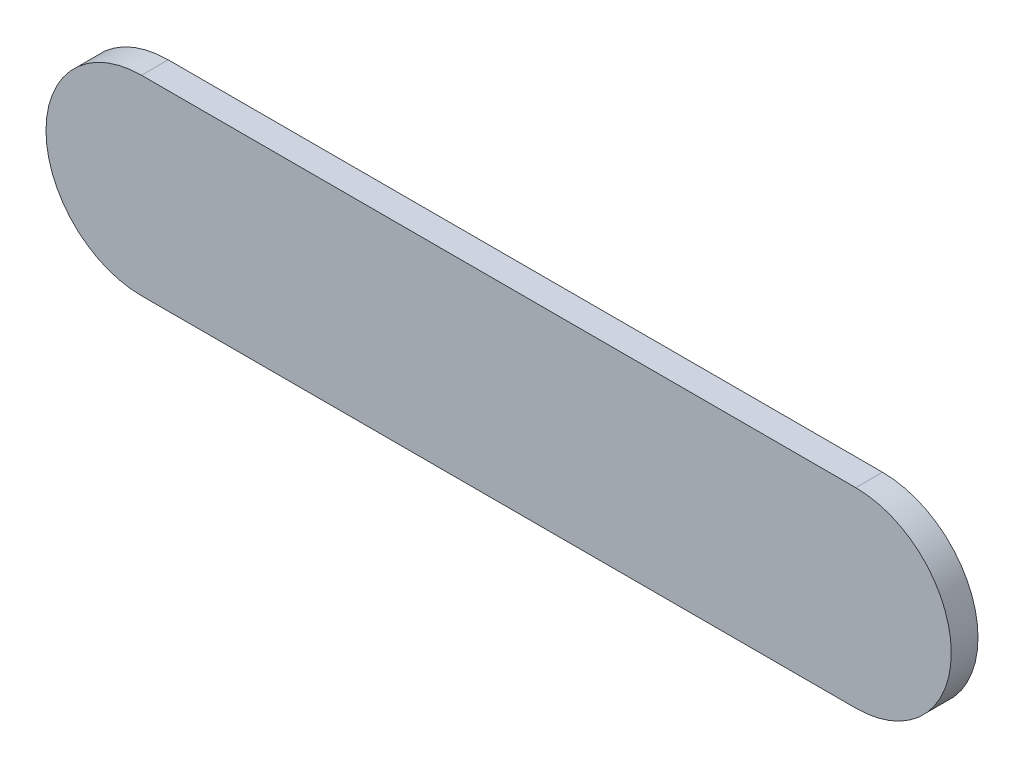
ISO-10303-21;
HEADER;
FILE_DESCRIPTION(('STEP AP214'),'2;1');
FILE_NAME('part.step','',(''),(''),'','','');
FILE_SCHEMA(('AUTOMOTIVE_DESIGN { 1 0 10303 214 1 1 1 1 }'));
ENDSEC;
DATA;
#1=APPLICATION_CONTEXT('core data for automotive mechanical design processes');
#2=APPLICATION_PROTOCOL_DEFINITION('international standard','automotive_design',2000,#1);
#3=PRODUCT_CONTEXT('',#1,'mechanical');
#4=PRODUCT('Part','Part','',(#3));
#5=PRODUCT_RELATED_PRODUCT_CATEGORY('part','',(#4));
#6=PRODUCT_DEFINITION_FORMATION('','',#4);
#7=PRODUCT_DEFINITION_CONTEXT('part definition',#1,'design');
#8=PRODUCT_DEFINITION('design','',#6,#7);
#9=PRODUCT_DEFINITION_SHAPE('','',#8);
#10=(LENGTH_UNIT() NAMED_UNIT(*) SI_UNIT(.MILLI.,.METRE.));
#11=(NAMED_UNIT(*) PLANE_ANGLE_UNIT() SI_UNIT($,.RADIAN.));
#12=(NAMED_UNIT(*) SI_UNIT($,.STERADIAN.) SOLID_ANGLE_UNIT());
#13=UNCERTAINTY_MEASURE_WITH_UNIT(LENGTH_MEASURE(1.E-05),#10,'distance_accuracy_value','');
#14=(GEOMETRIC_REPRESENTATION_CONTEXT(3) GLOBAL_UNCERTAINTY_ASSIGNED_CONTEXT((#13)) GLOBAL_UNIT_ASSIGNED_CONTEXT((#10,
#11,#12)) REPRESENTATION_CONTEXT('',''));
#15=CARTESIAN_POINT('',(0.,0.,0.));
#16=DIRECTION('',(0.,0.,1.));
#17=DIRECTION('',(1.,0.,0.));
#18=AXIS2_PLACEMENT_3D('',#15,#16,#17);
#19=CARTESIAN_POINT('',(96.3669904,84.0599284,0.));
#20=DIRECTION('',(0.,1.,0.));
#21=DIRECTION('',(1.,0.,0.));
#22=AXIS2_PLACEMENT_3D('',#19,#20,#21);
#23=PLANE('',#22);
#24=DIRECTION('',(1.,0.,0.));
#25=VECTOR('',#24,1.);
#26=CARTESIAN_POINT('',(96.3669904,84.0599284,0.03556));
#27=LINE('',#26,#25);
#28=CARTESIAN_POINT('',(96.3669904,84.0599284,0.03556));
#29=VERTEX_POINT('',#28);
#30=CARTESIAN_POINT('',(97.3170012,84.0599284,0.03556));
#31=VERTEX_POINT('',#30);
#32=EDGE_CURVE('E11',#29,#31,#27,.T.);
#33=ORIENTED_EDGE('',*,*,#32,.F.);
#34=DIRECTION('',(0.,0.,1.));
#35=VECTOR('',#34,1.);
#36=CARTESIAN_POINT('',(96.3669904,84.0599284,0.));
#37=LINE('',#36,#35);
#38=CARTESIAN_POINT('',(96.3669904,84.0599284,0.));
#39=VERTEX_POINT('',#38);
#40=EDGE_CURVE('E24',#39,#29,#37,.T.);
#41=ORIENTED_EDGE('',*,*,#40,.F.);
#42=DIRECTION('',(1.,0.,0.));
#43=VECTOR('',#42,1.);
#44=CARTESIAN_POINT('',(96.3669904,84.0599284,0.));
#45=LINE('',#44,#43);
#46=CARTESIAN_POINT('',(97.3170012,84.0599284,0.));
#47=VERTEX_POINT('',#46);
#48=EDGE_CURVE('E75',#39,#47,#45,.T.);
#49=ORIENTED_EDGE('',*,*,#48,.T.);
#50=DIRECTION('',(0.,0.,1.));
#51=VECTOR('',#50,1.);
#52=CARTESIAN_POINT('',(97.3170012,84.0599284,0.));
#53=LINE('',#52,#51);
#54=EDGE_CURVE('E37',#47,#31,#53,.T.);
#55=ORIENTED_EDGE('',*,*,#54,.T.);
#56=EDGE_LOOP('',(#33,#41,#49,#55));
#57=FACE_BOUND('',#56,.T.);
#58=ADVANCED_FACE('F17',(#57),#23,.F.);
#59=CARTESIAN_POINT('',(97.3170012,84.1869284,0.));
#60=DIRECTION('',(0.,0.,-1.));
#61=DIRECTION('',(0.,-1.,0.));
#62=AXIS2_PLACEMENT_3D('',#59,#60,#61);
#63=CYLINDRICAL_SURFACE('',#62,0.127);
#64=CARTESIAN_POINT('',(97.3170012,84.1869284,0.03556));
#65=DIRECTION('',(0.,0.,1.));
#66=DIRECTION('',(0.,-1.,0.));
#67=AXIS2_PLACEMENT_3D('',#64,#65,#66);
#68=CIRCLE('',#67,0.127);
#69=CARTESIAN_POINT('',(97.3170012,84.3139284,0.03556));
#70=VERTEX_POINT('',#69);
#71=EDGE_CURVE('E83',#31,#70,#68,.T.);
#72=ORIENTED_EDGE('',*,*,#71,.F.);
#73=ORIENTED_EDGE('',*,*,#54,.F.);
#74=CARTESIAN_POINT('',(97.3170012,84.1869284,0.));
#75=DIRECTION('',(0.,0.,1.));
#76=DIRECTION('',(0.,-1.,0.));
#77=AXIS2_PLACEMENT_3D('',#74,#75,#76);
#78=CIRCLE('',#77,0.127);
#79=CARTESIAN_POINT('',(97.3170012,84.3139284,0.));
#80=VERTEX_POINT('',#79);
#81=EDGE_CURVE('E81',#47,#80,#78,.T.);
#82=ORIENTED_EDGE('',*,*,#81,.T.);
#83=DIRECTION('',(0.,0.,1.));
#84=VECTOR('',#83,1.);
#85=CARTESIAN_POINT('',(97.3170012,84.3139284,0.));
#86=LINE('',#85,#84);
#87=EDGE_CURVE('E67',#80,#70,#86,.T.);
#88=ORIENTED_EDGE('',*,*,#87,.T.);
#89=EDGE_LOOP('',(#72,#73,#82,#88));
#90=FACE_BOUND('',#89,.T.);
#91=ADVANCED_FACE('F89',(#90),#63,.T.);
#92=CARTESIAN_POINT('',(97.3170012,84.3139284,0.));
#93=DIRECTION('',(0.,-1.,0.));
#94=DIRECTION('',(-1.,0.,0.));
#95=AXIS2_PLACEMENT_3D('',#92,#93,#94);
#96=PLANE('',#95);
#97=DIRECTION('',(-1.,0.,0.));
#98=VECTOR('',#97,1.);
#99=CARTESIAN_POINT('',(97.3170012,84.3139284,0.03556));
#100=LINE('',#99,#98);
#101=CARTESIAN_POINT('',(96.3669904,84.3139284,0.03556));
#102=VERTEX_POINT('',#101);
#103=EDGE_CURVE('E71',#70,#102,#100,.T.);
#104=ORIENTED_EDGE('',*,*,#103,.F.);
#105=ORIENTED_EDGE('',*,*,#87,.F.);
#106=DIRECTION('',(-1.,0.,0.));
#107=VECTOR('',#106,1.);
#108=CARTESIAN_POINT('',(97.3170012,84.3139284,0.));
#109=LINE('',#108,#107);
#110=CARTESIAN_POINT('',(96.3669904,84.3139284,0.));
#111=VERTEX_POINT('',#110);
#112=EDGE_CURVE('E63',#80,#111,#109,.T.);
#113=ORIENTED_EDGE('',*,*,#112,.T.);
#114=DIRECTION('',(0.,0.,1.));
#115=VECTOR('',#114,1.);
#116=CARTESIAN_POINT('',(96.3669904,84.3139284,0.));
#117=LINE('',#116,#115);
#118=EDGE_CURVE('E53',#111,#102,#117,.T.);
#119=ORIENTED_EDGE('',*,*,#118,.T.);
#120=EDGE_LOOP('',(#104,#105,#113,#119));
#121=FACE_BOUND('',#120,.T.);
#122=ADVANCED_FACE('F66',(#121),#96,.F.);
#123=CARTESIAN_POINT('',(96.3669904,84.1869284,0.));
#124=DIRECTION('',(0.,0.,-1.));
#125=DIRECTION('',(0.,1.,0.));
#126=AXIS2_PLACEMENT_3D('',#123,#124,#125);
#127=CYLINDRICAL_SURFACE('',#126,0.126999999999995);
#128=CARTESIAN_POINT('',(96.3669904,84.1869284,0.03556));
#129=DIRECTION('',(0.,0.,1.));
#130=DIRECTION('',(0.,1.,0.));
#131=AXIS2_PLACEMENT_3D('',#128,#129,#130);
#132=CIRCLE('',#131,0.126999999999995);
#133=EDGE_CURVE('E59',#102,#29,#132,.T.);
#134=ORIENTED_EDGE('',*,*,#133,.F.);
#135=ORIENTED_EDGE('',*,*,#118,.F.);
#136=CARTESIAN_POINT('',(96.3669904,84.1869284,0.));
#137=DIRECTION('',(0.,0.,1.));
#138=DIRECTION('',(0.,1.,0.));
#139=AXIS2_PLACEMENT_3D('',#136,#137,#138);
#140=CIRCLE('',#139,0.126999999999995);
#141=EDGE_CURVE('E57',#111,#39,#140,.T.);
#142=ORIENTED_EDGE('',*,*,#141,.T.);
#143=ORIENTED_EDGE('',*,*,#40,.T.);
#144=EDGE_LOOP('',(#134,#135,#142,#143));
#145=FACE_BOUND('',#144,.T.);
#146=ADVANCED_FACE('F55',(#145),#127,.T.);
#147=CARTESIAN_POINT('',(96.3669904,84.0599284,0.));
#148=DIRECTION('',(0.,0.,-1.));
#149=DIRECTION('',(-1.,0.,0.));
#150=AXIS2_PLACEMENT_3D('',#147,#148,#149);
#151=PLANE('',#150);
#152=ORIENTED_EDGE('',*,*,#141,.F.);
#153=ORIENTED_EDGE('',*,*,#112,.F.);
#154=ORIENTED_EDGE('',*,*,#81,.F.);
#155=ORIENTED_EDGE('',*,*,#48,.F.);
#156=EDGE_LOOP('',(#152,#153,#154,#155));
#157=FACE_BOUND('',#156,.T.);
#158=ADVANCED_FACE('F74',(#157),#151,.T.);
#159=CARTESIAN_POINT('',(96.3669904,84.0599284,0.03556));
#160=DIRECTION('',(0.,0.,-1.));
#161=DIRECTION('',(-1.,0.,0.));
#162=AXIS2_PLACEMENT_3D('',#159,#160,#161);
#163=PLANE('',#162);
#164=ORIENTED_EDGE('',*,*,#32,.T.);
#165=ORIENTED_EDGE('',*,*,#71,.T.);
#166=ORIENTED_EDGE('',*,*,#103,.T.);
#167=ORIENTED_EDGE('',*,*,#133,.T.);
#168=EDGE_LOOP('',(#164,#165,#166,#167));
#169=FACE_BOUND('',#168,.T.);
#170=ADVANCED_FACE('F91',(#169),#163,.F.);
#171=CLOSED_SHELL('',(#58,#91,#122,#146,#158,#170));
#172=MANIFOLD_SOLID_BREP('B1',#171);
#173=ADVANCED_BREP_SHAPE_REPRESENTATION('',(#18,#172),#14);
#174=SHAPE_DEFINITION_REPRESENTATION(#9,#173);
ENDSEC;
END-ISO-10303-21;
